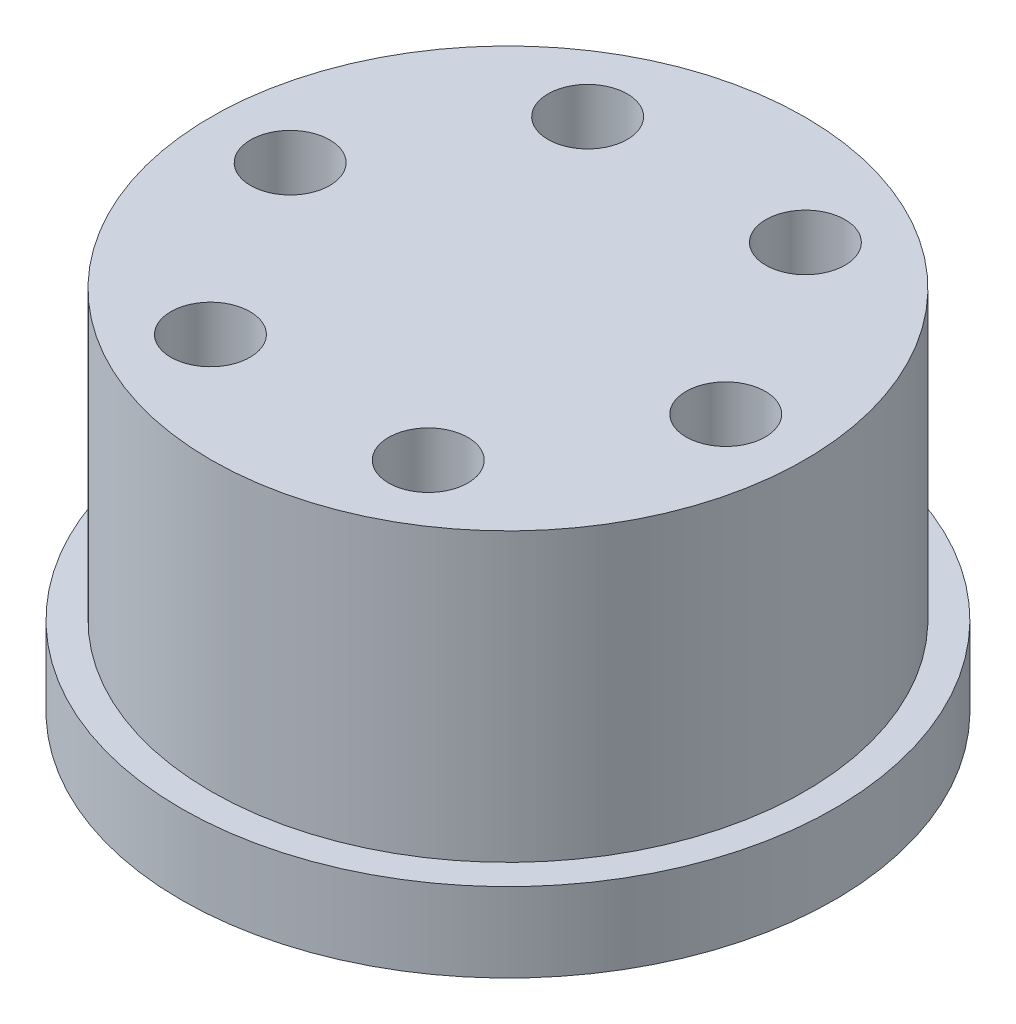
ISO-10303-21;
HEADER;
FILE_DESCRIPTION(('STEP AP214'),'2;1');
FILE_NAME('part.step','',(''),(''),'','','');
FILE_SCHEMA(('AUTOMOTIVE_DESIGN { 1 0 10303 214 1 1 1 1 }'));
ENDSEC;
DATA;
#1=APPLICATION_CONTEXT('core data for automotive mechanical design processes');
#2=APPLICATION_PROTOCOL_DEFINITION('international standard','automotive_design',2000,#1);
#3=PRODUCT_CONTEXT('',#1,'mechanical');
#4=PRODUCT('Part','Part','',(#3));
#5=PRODUCT_RELATED_PRODUCT_CATEGORY('part','',(#4));
#6=PRODUCT_DEFINITION_FORMATION('','',#4);
#7=PRODUCT_DEFINITION_CONTEXT('part definition',#1,'design');
#8=PRODUCT_DEFINITION('design','',#6,#7);
#9=PRODUCT_DEFINITION_SHAPE('','',#8);
#10=(LENGTH_UNIT() NAMED_UNIT(*) SI_UNIT(.MILLI.,.METRE.));
#11=(NAMED_UNIT(*) PLANE_ANGLE_UNIT() SI_UNIT($,.RADIAN.));
#12=(NAMED_UNIT(*) SI_UNIT($,.STERADIAN.) SOLID_ANGLE_UNIT());
#13=UNCERTAINTY_MEASURE_WITH_UNIT(LENGTH_MEASURE(1.E-05),#10,'distance_accuracy_value','');
#14=(GEOMETRIC_REPRESENTATION_CONTEXT(3) GLOBAL_UNCERTAINTY_ASSIGNED_CONTEXT((#13)) GLOBAL_UNIT_ASSIGNED_CONTEXT((#10,
#11,#12)) REPRESENTATION_CONTEXT('',''));
#15=CARTESIAN_POINT('',(0.,0.,0.));
#16=DIRECTION('',(0.,0.,1.));
#17=DIRECTION('',(1.,0.,0.));
#18=AXIS2_PLACEMENT_3D('',#15,#16,#17);
#19=CARTESIAN_POINT('',(0.,4.,0.));
#20=DIRECTION('',(0.,1.,0.));
#21=DIRECTION('',(0.,0.,1.));
#22=AXIS2_PLACEMENT_3D('',#19,#20,#21);
#23=PLANE('',#22);
#24=CARTESIAN_POINT('',(0.,4.,0.));
#25=DIRECTION('',(0.,1.,0.));
#26=DIRECTION('',(0.,0.,1.));
#27=AXIS2_PLACEMENT_3D('',#24,#25,#26);
#28=CIRCLE('',#27,15.);
#29=CARTESIAN_POINT('',(0.,4.,15.));
#30=VERTEX_POINT('',#29);
#31=EDGE_CURVE('E10',#30,#30,#28,.T.);
#32=ORIENTED_EDGE('',*,*,#31,.F.);
#33=EDGE_LOOP('',(#32));
#34=FACE_BOUND('',#33,.T.);
#35=CARTESIAN_POINT('',(0.,4.,0.));
#36=DIRECTION('',(0.,1.,0.));
#37=DIRECTION('',(0.,0.,1.));
#38=AXIS2_PLACEMENT_3D('',#35,#36,#37);
#39=CIRCLE('',#38,16.5);
#40=CARTESIAN_POINT('',(0.,4.,16.5));
#41=VERTEX_POINT('',#40);
#42=EDGE_CURVE('E41',#41,#41,#39,.T.);
#43=ORIENTED_EDGE('',*,*,#42,.T.);
#44=EDGE_LOOP('',(#43));
#45=FACE_BOUND('',#44,.T.);
#46=ADVANCED_FACE('F33',(#34,#45),#23,.T.);
#47=CARTESIAN_POINT('',(0.,0.,0.));
#48=DIRECTION('',(0.,1.,0.));
#49=DIRECTION('',(0.,0.,1.));
#50=AXIS2_PLACEMENT_3D('',#47,#48,#49);
#51=PLANE('',#50);
#52=CARTESIAN_POINT('',(0.,0.,0.));
#53=DIRECTION('',(0.,-1.,0.));
#54=DIRECTION('',(0.,0.,-1.));
#55=AXIS2_PLACEMENT_3D('',#52,#53,#54);
#56=CIRCLE('',#55,7.6);
#57=CARTESIAN_POINT('',(0.,0.,-7.6));
#58=VERTEX_POINT('',#57);
#59=EDGE_CURVE('E179',#58,#58,#56,.T.);
#60=ORIENTED_EDGE('',*,*,#59,.F.);
#61=EDGE_LOOP('',(#60));
#62=FACE_BOUND('',#61,.T.);
#63=CARTESIAN_POINT('',(0.,0.,0.));
#64=DIRECTION('',(0.,1.,0.));
#65=DIRECTION('',(0.,0.,1.));
#66=AXIS2_PLACEMENT_3D('',#63,#64,#65);
#67=CIRCLE('',#66,16.5);
#68=CARTESIAN_POINT('',(0.,0.,16.5));
#69=VERTEX_POINT('',#68);
#70=EDGE_CURVE('E37',#69,#69,#67,.T.);
#71=ORIENTED_EDGE('',*,*,#70,.F.);
#72=EDGE_LOOP('',(#71));
#73=FACE_BOUND('',#72,.T.);
#74=CARTESIAN_POINT('',(0.,0.,-12.5));
#75=DIRECTION('',(0.,1.,0.));
#76=DIRECTION('',(0.,0.,1.));
#77=AXIS2_PLACEMENT_3D('',#74,#75,#76);
#78=CIRCLE('',#77,1.65);
#79=CARTESIAN_POINT('',(0.,0.,-10.85));
#80=VERTEX_POINT('',#79);
#81=EDGE_CURVE('E81',#80,#80,#78,.T.);
#82=ORIENTED_EDGE('',*,*,#81,.T.);
#83=EDGE_LOOP('',(#82));
#84=FACE_BOUND('',#83,.T.);
#85=CARTESIAN_POINT('',(10.8253175473057,0.,-6.25000000000031));
#86=DIRECTION('',(0.,1.,0.));
#87=DIRECTION('',(0.,0.,1.));
#88=AXIS2_PLACEMENT_3D('',#85,#86,#87);
#89=CIRCLE('',#88,1.65);
#90=CARTESIAN_POINT('',(10.8253175473057,0.,-4.60000000000031));
#91=VERTEX_POINT('',#90);
#92=EDGE_CURVE('E76',#91,#91,#89,.T.);
#93=ORIENTED_EDGE('',*,*,#92,.T.);
#94=EDGE_LOOP('',(#93));
#95=FACE_BOUND('',#94,.T.);
#96=CARTESIAN_POINT('',(10.825317547306,0.,6.24999999999969));
#97=DIRECTION('',(0.,1.,0.));
#98=DIRECTION('',(0.,0.,1.));
#99=AXIS2_PLACEMENT_3D('',#96,#97,#98);
#100=CIRCLE('',#99,1.65);
#101=CARTESIAN_POINT('',(10.825317547306,0.,7.89999999999969));
#102=VERTEX_POINT('',#101);
#103=EDGE_CURVE('E70',#102,#102,#100,.T.);
#104=ORIENTED_EDGE('',*,*,#103,.T.);
#105=EDGE_LOOP('',(#104));
#106=FACE_BOUND('',#105,.T.);
#107=CARTESIAN_POINT('',(7.05950310263298E-13,0.,12.5));
#108=DIRECTION('',(0.,1.,0.));
#109=DIRECTION('',(0.,0.,1.));
#110=AXIS2_PLACEMENT_3D('',#107,#108,#109);
#111=CIRCLE('',#110,1.65);
#112=CARTESIAN_POINT('',(7.05950310263298E-13,0.,14.15));
#113=VERTEX_POINT('',#112);
#114=EDGE_CURVE('E64',#113,#113,#111,.T.);
#115=ORIENTED_EDGE('',*,*,#114,.T.);
#116=EDGE_LOOP('',(#115));
#117=FACE_BOUND('',#116,.T.);
#118=CARTESIAN_POINT('',(-10.825317547305,0.,6.25000000000031));
#119=DIRECTION('',(0.,1.,0.));
#120=DIRECTION('',(0.,0.,1.));
#121=AXIS2_PLACEMENT_3D('',#118,#119,#120);
#122=CIRCLE('',#121,1.65);
#123=CARTESIAN_POINT('',(-10.825317547305,0.,7.90000000000031));
#124=VERTEX_POINT('',#123);
#125=EDGE_CURVE('E57',#124,#124,#122,.T.);
#126=ORIENTED_EDGE('',*,*,#125,.T.);
#127=EDGE_LOOP('',(#126));
#128=FACE_BOUND('',#127,.T.);
#129=CARTESIAN_POINT('',(-10.8253175473053,0.,-6.24999999999969));
#130=DIRECTION('',(0.,1.,0.));
#131=DIRECTION('',(0.,0.,1.));
#132=AXIS2_PLACEMENT_3D('',#129,#130,#131);
#133=CIRCLE('',#132,1.65);
#134=CARTESIAN_POINT('',(-10.8253175473053,0.,-4.59999999999969));
#135=VERTEX_POINT('',#134);
#136=EDGE_CURVE('E54',#135,#135,#133,.T.);
#137=ORIENTED_EDGE('',*,*,#136,.T.);
#138=EDGE_LOOP('',(#137));
#139=FACE_BOUND('',#138,.T.);
#140=ADVANCED_FACE('F91',(#62,#73,#84,#95,#106,#117,#128,#139),#51,.F.);
#141=CARTESIAN_POINT('',(0.,4.,0.));
#142=DIRECTION('',(0.,-1.,0.));
#143=DIRECTION('',(0.,0.,-1.));
#144=AXIS2_PLACEMENT_3D('',#141,#142,#143);
#145=CYLINDRICAL_SURFACE('',#144,16.5);
#146=ORIENTED_EDGE('',*,*,#42,.F.);
#147=EDGE_LOOP('',(#146));
#148=FACE_BOUND('',#147,.T.);
#149=ORIENTED_EDGE('',*,*,#70,.T.);
#150=EDGE_LOOP('',(#149));
#151=FACE_BOUND('',#150,.T.);
#152=ADVANCED_FACE('F35',(#148,#151),#145,.T.);
#153=CARTESIAN_POINT('',(0.,4.,-12.5));
#154=DIRECTION('',(0.,-1.,0.));
#155=DIRECTION('',(0.,0.,-1.));
#156=AXIS2_PLACEMENT_3D('',#153,#154,#155);
#157=CYLINDRICAL_SURFACE('',#156,1.65);
#158=CARTESIAN_POINT('',(0.,4.,-12.5));
#159=DIRECTION('',(0.,1.,0.));
#160=DIRECTION('',(0.,0.,1.));
#161=AXIS2_PLACEMENT_3D('',#158,#159,#160);
#162=CIRCLE('',#161,1.65);
#163=CARTESIAN_POINT('',(0.,4.,-10.85));
#164=VERTEX_POINT('',#163);
#165=EDGE_CURVE('E73',#164,#164,#162,.T.);
#166=ORIENTED_EDGE('',*,*,#165,.T.);
#167=EDGE_LOOP('',(#166));
#168=FACE_BOUND('',#167,.T.);
#169=ORIENTED_EDGE('',*,*,#81,.F.);
#170=EDGE_LOOP('',(#169));
#171=FACE_BOUND('',#170,.T.);
#172=ADVANCED_FACE('F129',(#168,#171),#157,.F.);
#173=CARTESIAN_POINT('',(10.8253175473057,4.,-6.25000000000031));
#174=DIRECTION('',(0.,-1.,0.));
#175=DIRECTION('',(0.,0.,-1.));
#176=AXIS2_PLACEMENT_3D('',#173,#174,#175);
#177=CYLINDRICAL_SURFACE('',#176,1.65);
#178=CARTESIAN_POINT('',(10.8253175473057,4.,-6.25000000000031));
#179=DIRECTION('',(0.,1.,0.));
#180=DIRECTION('',(0.,0.,1.));
#181=AXIS2_PLACEMENT_3D('',#178,#179,#180);
#182=CIRCLE('',#181,1.65);
#183=CARTESIAN_POINT('',(10.8253175473057,4.,-4.60000000000031));
#184=VERTEX_POINT('',#183);
#185=EDGE_CURVE('E67',#184,#184,#182,.T.);
#186=ORIENTED_EDGE('',*,*,#185,.T.);
#187=EDGE_LOOP('',(#186));
#188=FACE_BOUND('',#187,.T.);
#189=ORIENTED_EDGE('',*,*,#92,.F.);
#190=EDGE_LOOP('',(#189));
#191=FACE_BOUND('',#190,.T.);
#192=ADVANCED_FACE('F132',(#188,#191),#177,.F.);
#193=CARTESIAN_POINT('',(10.825317547306,4.,6.24999999999969));
#194=DIRECTION('',(0.,-1.,0.));
#195=DIRECTION('',(0.,0.,-1.));
#196=AXIS2_PLACEMENT_3D('',#193,#194,#195);
#197=CYLINDRICAL_SURFACE('',#196,1.65);
#198=CARTESIAN_POINT('',(10.825317547306,4.,6.24999999999969));
#199=DIRECTION('',(0.,1.,0.));
#200=DIRECTION('',(0.,0.,1.));
#201=AXIS2_PLACEMENT_3D('',#198,#199,#200);
#202=CIRCLE('',#201,1.65);
#203=CARTESIAN_POINT('',(10.825317547306,4.,7.89999999999969));
#204=VERTEX_POINT('',#203);
#205=EDGE_CURVE('E61',#204,#204,#202,.T.);
#206=ORIENTED_EDGE('',*,*,#205,.T.);
#207=EDGE_LOOP('',(#206));
#208=FACE_BOUND('',#207,.T.);
#209=ORIENTED_EDGE('',*,*,#103,.F.);
#210=EDGE_LOOP('',(#209));
#211=FACE_BOUND('',#210,.T.);
#212=ADVANCED_FACE('F136',(#208,#211),#197,.F.);
#213=CARTESIAN_POINT('',(7.05950310263298E-13,4.,12.5));
#214=DIRECTION('',(0.,-1.,0.));
#215=DIRECTION('',(0.,0.,-1.));
#216=AXIS2_PLACEMENT_3D('',#213,#214,#215);
#217=CYLINDRICAL_SURFACE('',#216,1.65);
#218=CARTESIAN_POINT('',(7.05950310263298E-13,4.,12.5));
#219=DIRECTION('',(0.,1.,0.));
#220=DIRECTION('',(0.,0.,1.));
#221=AXIS2_PLACEMENT_3D('',#218,#219,#220);
#222=CIRCLE('',#221,1.65);
#223=CARTESIAN_POINT('',(7.05950310263298E-13,4.,14.15));
#224=VERTEX_POINT('',#223);
#225=EDGE_CURVE('E53',#224,#224,#222,.T.);
#226=ORIENTED_EDGE('',*,*,#225,.T.);
#227=EDGE_LOOP('',(#226));
#228=FACE_BOUND('',#227,.T.);
#229=ORIENTED_EDGE('',*,*,#114,.F.);
#230=EDGE_LOOP('',(#229));
#231=FACE_BOUND('',#230,.T.);
#232=ADVANCED_FACE('F118',(#228,#231),#217,.F.);
#233=CARTESIAN_POINT('',(-10.825317547305,4.,6.25000000000031));
#234=DIRECTION('',(0.,-1.,0.));
#235=DIRECTION('',(0.,0.,-1.));
#236=AXIS2_PLACEMENT_3D('',#233,#234,#235);
#237=CYLINDRICAL_SURFACE('',#236,1.65);
#238=CARTESIAN_POINT('',(-10.825317547305,4.,6.25000000000031));
#239=DIRECTION('',(0.,1.,0.));
#240=DIRECTION('',(0.,0.,1.));
#241=AXIS2_PLACEMENT_3D('',#238,#239,#240);
#242=CIRCLE('',#241,1.65);
#243=CARTESIAN_POINT('',(-10.825317547305,4.,7.90000000000031));
#244=VERTEX_POINT('',#243);
#245=EDGE_CURVE('E58',#244,#244,#242,.T.);
#246=ORIENTED_EDGE('',*,*,#245,.T.);
#247=EDGE_LOOP('',(#246));
#248=FACE_BOUND('',#247,.T.);
#249=ORIENTED_EDGE('',*,*,#125,.F.);
#250=EDGE_LOOP('',(#249));
#251=FACE_BOUND('',#250,.T.);
#252=ADVANCED_FACE('F108',(#248,#251),#237,.F.);
#253=CARTESIAN_POINT('',(-10.8253175473053,4.,-6.24999999999969));
#254=DIRECTION('',(0.,-1.,0.));
#255=DIRECTION('',(0.,0.,-1.));
#256=AXIS2_PLACEMENT_3D('',#253,#254,#255);
#257=CYLINDRICAL_SURFACE('',#256,1.65);
#258=CARTESIAN_POINT('',(-10.8253175473053,4.,-6.24999999999969));
#259=DIRECTION('',(0.,1.,0.));
#260=DIRECTION('',(0.,0.,1.));
#261=AXIS2_PLACEMENT_3D('',#258,#259,#260);
#262=CIRCLE('',#261,1.65);
#263=CARTESIAN_POINT('',(-10.8253175473053,4.,-4.59999999999969));
#264=VERTEX_POINT('',#263);
#265=EDGE_CURVE('E50',#264,#264,#262,.T.);
#266=ORIENTED_EDGE('',*,*,#265,.T.);
#267=EDGE_LOOP('',(#266));
#268=FACE_BOUND('',#267,.T.);
#269=ORIENTED_EDGE('',*,*,#136,.F.);
#270=EDGE_LOOP('',(#269));
#271=FACE_BOUND('',#270,.T.);
#272=ADVANCED_FACE('F105',(#268,#271),#257,.F.);
#273=CARTESIAN_POINT('',(0.,18.5,0.));
#274=DIRECTION('',(0.,1.,0.));
#275=DIRECTION('',(0.,0.,1.));
#276=AXIS2_PLACEMENT_3D('',#273,#274,#275);
#277=PLANE('',#276);
#278=CARTESIAN_POINT('',(-11.,18.5,0.));
#279=DIRECTION('',(0.,1.,0.));
#280=DIRECTION('',(0.,0.,1.));
#281=AXIS2_PLACEMENT_3D('',#278,#279,#280);
#282=CIRCLE('',#281,2.);
#283=CARTESIAN_POINT('',(-11.,18.5,2.));
#284=VERTEX_POINT('',#283);
#285=EDGE_CURVE('E171',#284,#284,#282,.T.);
#286=ORIENTED_EDGE('',*,*,#285,.F.);
#287=EDGE_LOOP('',(#286));
#288=FACE_BOUND('',#287,.T.);
#289=CARTESIAN_POINT('',(-5.49999999999999,18.5,9.52627944162883));
#290=DIRECTION('',(0.,1.,0.));
#291=DIRECTION('',(0.,0.,1.));
#292=AXIS2_PLACEMENT_3D('',#289,#290,#291);
#293=CIRCLE('',#292,2.);
#294=CARTESIAN_POINT('',(-5.49999999999999,18.5,11.5262794416288));
#295=VERTEX_POINT('',#294);
#296=EDGE_CURVE('E186',#295,#295,#293,.T.);
#297=ORIENTED_EDGE('',*,*,#296,.F.);
#298=EDGE_LOOP('',(#297));
#299=FACE_BOUND('',#298,.T.);
#300=CARTESIAN_POINT('',(5.5,18.5,9.52627944162882));
#301=DIRECTION('',(0.,1.,0.));
#302=DIRECTION('',(0.,0.,1.));
#303=AXIS2_PLACEMENT_3D('',#300,#301,#302);
#304=CIRCLE('',#303,2.);
#305=CARTESIAN_POINT('',(5.5,18.5,11.5262794416288));
#306=VERTEX_POINT('',#305);
#307=EDGE_CURVE('E185',#306,#306,#304,.T.);
#308=ORIENTED_EDGE('',*,*,#307,.F.);
#309=EDGE_LOOP('',(#308));
#310=FACE_BOUND('',#309,.T.);
#311=CARTESIAN_POINT('',(11.,18.5,0.));
#312=DIRECTION('',(0.,1.,0.));
#313=DIRECTION('',(0.,0.,1.));
#314=AXIS2_PLACEMENT_3D('',#311,#312,#313);
#315=CIRCLE('',#314,2.);
#316=CARTESIAN_POINT('',(11.,18.5,2.));
#317=VERTEX_POINT('',#316);
#318=EDGE_CURVE('E204',#317,#317,#315,.T.);
#319=ORIENTED_EDGE('',*,*,#318,.F.);
#320=EDGE_LOOP('',(#319));
#321=FACE_BOUND('',#320,.T.);
#322=CARTESIAN_POINT('',(5.5,18.5,-9.52627944162883));
#323=DIRECTION('',(0.,1.,0.));
#324=DIRECTION('',(0.,0.,1.));
#325=AXIS2_PLACEMENT_3D('',#322,#323,#324);
#326=CIRCLE('',#325,2.);
#327=CARTESIAN_POINT('',(5.5,18.5,-7.52627944162883));
#328=VERTEX_POINT('',#327);
#329=EDGE_CURVE('E198',#328,#328,#326,.T.);
#330=ORIENTED_EDGE('',*,*,#329,.F.);
#331=EDGE_LOOP('',(#330));
#332=FACE_BOUND('',#331,.T.);
#333=CARTESIAN_POINT('',(-5.5,18.5,-9.52627944162882));
#334=DIRECTION('',(0.,1.,0.));
#335=DIRECTION('',(0.,0.,1.));
#336=AXIS2_PLACEMENT_3D('',#333,#334,#335);
#337=CIRCLE('',#336,2.);
#338=CARTESIAN_POINT('',(-5.5,18.5,-7.52627944162882));
#339=VERTEX_POINT('',#338);
#340=EDGE_CURVE('E192',#339,#339,#337,.T.);
#341=ORIENTED_EDGE('',*,*,#340,.F.);
#342=EDGE_LOOP('',(#341));
#343=FACE_BOUND('',#342,.T.);
#344=CARTESIAN_POINT('',(0.,18.5,0.));
#345=DIRECTION('',(0.,1.,0.));
#346=DIRECTION('',(0.,0.,1.));
#347=AXIS2_PLACEMENT_3D('',#344,#345,#346);
#348=CIRCLE('',#347,15.);
#349=CARTESIAN_POINT('',(0.,18.5,15.));
#350=VERTEX_POINT('',#349);
#351=EDGE_CURVE('E48',#350,#350,#348,.T.);
#352=ORIENTED_EDGE('',*,*,#351,.T.);
#353=EDGE_LOOP('',(#352));
#354=FACE_BOUND('',#353,.T.);
#355=ADVANCED_FACE('F107',(#288,#299,#310,#321,#332,#343,#354),#277,.T.);
#356=CARTESIAN_POINT('',(0.,18.5,0.));
#357=DIRECTION('',(0.,-1.,0.));
#358=DIRECTION('',(0.,0.,-1.));
#359=AXIS2_PLACEMENT_3D('',#356,#357,#358);
#360=CYLINDRICAL_SURFACE('',#359,15.);
#361=ORIENTED_EDGE('',*,*,#351,.F.);
#362=EDGE_LOOP('',(#361));
#363=FACE_BOUND('',#362,.T.);
#364=ORIENTED_EDGE('',*,*,#31,.T.);
#365=EDGE_LOOP('',(#364));
#366=FACE_BOUND('',#365,.T.);
#367=ADVANCED_FACE('F115',(#363,#366),#360,.T.);
#368=CARTESIAN_POINT('',(0.,4.,0.));
#369=DIRECTION('',(0.,1.,0.));
#370=DIRECTION('',(0.,0.,1.));
#371=AXIS2_PLACEMENT_3D('',#368,#369,#370);
#372=PLANE('',#371);
#373=ORIENTED_EDGE('',*,*,#265,.F.);
#374=EDGE_LOOP('',(#373));
#375=FACE_BOUND('',#374,.T.);
#376=ADVANCED_FACE('F151',(#375),#372,.F.);
#377=ORIENTED_EDGE('',*,*,#225,.F.);
#378=EDGE_LOOP('',(#377));
#379=FACE_BOUND('',#378,.T.);
#380=ADVANCED_FACE('F148',(#379),#372,.F.);
#381=ORIENTED_EDGE('',*,*,#185,.F.);
#382=EDGE_LOOP('',(#381));
#383=FACE_BOUND('',#382,.T.);
#384=ADVANCED_FACE('F150',(#383),#372,.F.);
#385=ORIENTED_EDGE('',*,*,#165,.F.);
#386=EDGE_LOOP('',(#385));
#387=FACE_BOUND('',#386,.T.);
#388=ADVANCED_FACE('F157',(#387),#372,.F.);
#389=ORIENTED_EDGE('',*,*,#205,.F.);
#390=EDGE_LOOP('',(#389));
#391=FACE_BOUND('',#390,.T.);
#392=ADVANCED_FACE('F233',(#391),#372,.F.);
#393=ORIENTED_EDGE('',*,*,#245,.F.);
#394=EDGE_LOOP('',(#393));
#395=FACE_BOUND('',#394,.T.);
#396=ADVANCED_FACE('F160',(#395),#372,.F.);
#397=CARTESIAN_POINT('',(-5.5,12.,-9.52627944162882));
#398=DIRECTION('',(0.,1.,0.));
#399=DIRECTION('',(0.,0.,1.));
#400=AXIS2_PLACEMENT_3D('',#397,#398,#399);
#401=CYLINDRICAL_SURFACE('',#400,2.);
#402=CARTESIAN_POINT('',(-5.5,12.,-9.52627944162882));
#403=DIRECTION('',(0.,1.,0.));
#404=DIRECTION('',(0.,0.,1.));
#405=AXIS2_PLACEMENT_3D('',#402,#403,#404);
#406=CIRCLE('',#405,2.);
#407=CARTESIAN_POINT('',(-5.5,12.,-7.52627944162882));
#408=VERTEX_POINT('',#407);
#409=EDGE_CURVE('E176',#408,#408,#406,.T.);
#410=ORIENTED_EDGE('',*,*,#409,.F.);
#411=EDGE_LOOP('',(#410));
#412=FACE_BOUND('',#411,.T.);
#413=ORIENTED_EDGE('',*,*,#340,.T.);
#414=EDGE_LOOP('',(#413));
#415=FACE_BOUND('',#414,.T.);
#416=ADVANCED_FACE('F221',(#412,#415),#401,.F.);
#417=CARTESIAN_POINT('',(-5.5,12.,-9.52627944162882));
#418=DIRECTION('',(0.,1.,0.));
#419=DIRECTION('',(0.,0.,1.));
#420=AXIS2_PLACEMENT_3D('',#417,#418,#419);
#421=PLANE('',#420);
#422=ORIENTED_EDGE('',*,*,#409,.T.);
#423=EDGE_LOOP('',(#422));
#424=FACE_BOUND('',#423,.T.);
#425=ADVANCED_FACE('F223',(#424),#421,.T.);
#426=CARTESIAN_POINT('',(5.5,12.,-9.52627944162883));
#427=DIRECTION('',(0.,1.,0.));
#428=DIRECTION('',(0.,0.,1.));
#429=AXIS2_PLACEMENT_3D('',#426,#427,#428);
#430=CYLINDRICAL_SURFACE('',#429,2.);
#431=CARTESIAN_POINT('',(5.5,12.,-9.52627944162883));
#432=DIRECTION('',(0.,1.,0.));
#433=DIRECTION('',(0.,0.,1.));
#434=AXIS2_PLACEMENT_3D('',#431,#432,#433);
#435=CIRCLE('',#434,2.);
#436=CARTESIAN_POINT('',(5.5,12.,-7.52627944162883));
#437=VERTEX_POINT('',#436);
#438=EDGE_CURVE('E195',#437,#437,#435,.T.);
#439=ORIENTED_EDGE('',*,*,#438,.F.);
#440=EDGE_LOOP('',(#439));
#441=FACE_BOUND('',#440,.T.);
#442=ORIENTED_EDGE('',*,*,#329,.T.);
#443=EDGE_LOOP('',(#442));
#444=FACE_BOUND('',#443,.T.);
#445=ADVANCED_FACE('F230',(#441,#444),#430,.F.);
#446=CARTESIAN_POINT('',(5.5,12.,-9.52627944162883));
#447=DIRECTION('',(0.,1.,0.));
#448=DIRECTION('',(0.,0.,1.));
#449=AXIS2_PLACEMENT_3D('',#446,#447,#448);
#450=PLANE('',#449);
#451=ORIENTED_EDGE('',*,*,#438,.T.);
#452=EDGE_LOOP('',(#451));
#453=FACE_BOUND('',#452,.T.);
#454=ADVANCED_FACE('F238',(#453),#450,.T.);
#455=CARTESIAN_POINT('',(11.,12.,0.));
#456=DIRECTION('',(0.,1.,0.));
#457=DIRECTION('',(0.,0.,1.));
#458=AXIS2_PLACEMENT_3D('',#455,#456,#457);
#459=CYLINDRICAL_SURFACE('',#458,2.);
#460=CARTESIAN_POINT('',(11.,12.,0.));
#461=DIRECTION('',(0.,1.,0.));
#462=DIRECTION('',(0.,0.,1.));
#463=AXIS2_PLACEMENT_3D('',#460,#461,#462);
#464=CIRCLE('',#463,2.);
#465=CARTESIAN_POINT('',(11.,12.,2.));
#466=VERTEX_POINT('',#465);
#467=EDGE_CURVE('E201',#466,#466,#464,.T.);
#468=ORIENTED_EDGE('',*,*,#467,.F.);
#469=EDGE_LOOP('',(#468));
#470=FACE_BOUND('',#469,.T.);
#471=ORIENTED_EDGE('',*,*,#318,.T.);
#472=EDGE_LOOP('',(#471));
#473=FACE_BOUND('',#472,.T.);
#474=ADVANCED_FACE('F241',(#470,#473),#459,.F.);
#475=CARTESIAN_POINT('',(11.,12.,0.));
#476=DIRECTION('',(0.,1.,0.));
#477=DIRECTION('',(0.,0.,1.));
#478=AXIS2_PLACEMENT_3D('',#475,#476,#477);
#479=PLANE('',#478);
#480=ORIENTED_EDGE('',*,*,#467,.T.);
#481=EDGE_LOOP('',(#480));
#482=FACE_BOUND('',#481,.T.);
#483=ADVANCED_FACE('F246',(#482),#479,.T.);
#484=CARTESIAN_POINT('',(5.5,12.,9.52627944162882));
#485=DIRECTION('',(0.,1.,0.));
#486=DIRECTION('',(0.,0.,1.));
#487=AXIS2_PLACEMENT_3D('',#484,#485,#486);
#488=CYLINDRICAL_SURFACE('',#487,2.);
#489=CARTESIAN_POINT('',(5.5,12.,9.52627944162882));
#490=DIRECTION('',(0.,1.,0.));
#491=DIRECTION('',(0.,0.,1.));
#492=AXIS2_PLACEMENT_3D('',#489,#490,#491);
#493=CIRCLE('',#492,2.);
#494=CARTESIAN_POINT('',(5.5,12.,11.5262794416288));
#495=VERTEX_POINT('',#494);
#496=EDGE_CURVE('E207',#495,#495,#493,.T.);
#497=ORIENTED_EDGE('',*,*,#496,.F.);
#498=EDGE_LOOP('',(#497));
#499=FACE_BOUND('',#498,.T.);
#500=ORIENTED_EDGE('',*,*,#307,.T.);
#501=EDGE_LOOP('',(#500));
#502=FACE_BOUND('',#501,.T.);
#503=ADVANCED_FACE('F212',(#499,#502),#488,.F.);
#504=CARTESIAN_POINT('',(5.5,12.,9.52627944162882));
#505=DIRECTION('',(0.,1.,0.));
#506=DIRECTION('',(0.,0.,1.));
#507=AXIS2_PLACEMENT_3D('',#504,#505,#506);
#508=PLANE('',#507);
#509=ORIENTED_EDGE('',*,*,#496,.T.);
#510=EDGE_LOOP('',(#509));
#511=FACE_BOUND('',#510,.T.);
#512=ADVANCED_FACE('F253',(#511),#508,.T.);
#513=CARTESIAN_POINT('',(-5.49999999999999,12.,9.52627944162883));
#514=DIRECTION('',(0.,1.,0.));
#515=DIRECTION('',(0.,0.,1.));
#516=AXIS2_PLACEMENT_3D('',#513,#514,#515);
#517=CYLINDRICAL_SURFACE('',#516,2.);
#518=CARTESIAN_POINT('',(-5.49999999999999,12.,9.52627944162883));
#519=DIRECTION('',(0.,1.,0.));
#520=DIRECTION('',(0.,0.,1.));
#521=AXIS2_PLACEMENT_3D('',#518,#519,#520);
#522=CIRCLE('',#521,2.);
#523=CARTESIAN_POINT('',(-5.49999999999999,12.,11.5262794416288));
#524=VERTEX_POINT('',#523);
#525=EDGE_CURVE('E182',#524,#524,#522,.T.);
#526=ORIENTED_EDGE('',*,*,#525,.F.);
#527=EDGE_LOOP('',(#526));
#528=FACE_BOUND('',#527,.T.);
#529=ORIENTED_EDGE('',*,*,#296,.T.);
#530=EDGE_LOOP('',(#529));
#531=FACE_BOUND('',#530,.T.);
#532=ADVANCED_FACE('F255',(#528,#531),#517,.F.);
#533=CARTESIAN_POINT('',(-5.49999999999999,12.,9.52627944162883));
#534=DIRECTION('',(0.,1.,0.));
#535=DIRECTION('',(0.,0.,1.));
#536=AXIS2_PLACEMENT_3D('',#533,#534,#535);
#537=PLANE('',#536);
#538=ORIENTED_EDGE('',*,*,#525,.T.);
#539=EDGE_LOOP('',(#538));
#540=FACE_BOUND('',#539,.T.);
#541=ADVANCED_FACE('F274',(#540),#537,.T.);
#542=CARTESIAN_POINT('',(-11.,12.,0.));
#543=DIRECTION('',(0.,1.,0.));
#544=DIRECTION('',(0.,0.,1.));
#545=AXIS2_PLACEMENT_3D('',#542,#543,#544);
#546=CYLINDRICAL_SURFACE('',#545,2.);
#547=CARTESIAN_POINT('',(-11.,12.,0.));
#548=DIRECTION('',(0.,1.,0.));
#549=DIRECTION('',(0.,0.,1.));
#550=AXIS2_PLACEMENT_3D('',#547,#548,#549);
#551=CIRCLE('',#550,2.);
#552=CARTESIAN_POINT('',(-11.,12.,2.));
#553=VERTEX_POINT('',#552);
#554=EDGE_CURVE('E169',#553,#553,#551,.T.);
#555=ORIENTED_EDGE('',*,*,#554,.F.);
#556=EDGE_LOOP('',(#555));
#557=FACE_BOUND('',#556,.T.);
#558=ORIENTED_EDGE('',*,*,#285,.T.);
#559=EDGE_LOOP('',(#558));
#560=FACE_BOUND('',#559,.T.);
#561=ADVANCED_FACE('F281',(#557,#560),#546,.F.);
#562=CARTESIAN_POINT('',(-11.,12.,0.));
#563=DIRECTION('',(0.,1.,0.));
#564=DIRECTION('',(0.,0.,1.));
#565=AXIS2_PLACEMENT_3D('',#562,#563,#564);
#566=PLANE('',#565);
#567=ORIENTED_EDGE('',*,*,#554,.T.);
#568=EDGE_LOOP('',(#567));
#569=FACE_BOUND('',#568,.T.);
#570=ADVANCED_FACE('F289',(#569),#566,.T.);
#571=CARTESIAN_POINT('',(0.,5.,0.));
#572=DIRECTION('',(0.,-1.,0.));
#573=DIRECTION('',(0.,0.,-1.));
#574=AXIS2_PLACEMENT_3D('',#571,#572,#573);
#575=CYLINDRICAL_SURFACE('',#574,7.6);
#576=CARTESIAN_POINT('',(0.,5.,0.));
#577=DIRECTION('',(0.,-1.,0.));
#578=DIRECTION('',(0.,0.,-1.));
#579=AXIS2_PLACEMENT_3D('',#576,#577,#578);
#580=CIRCLE('',#579,7.6);
#581=CARTESIAN_POINT('',(0.,5.,-7.6));
#582=VERTEX_POINT('',#581);
#583=EDGE_CURVE('E189',#582,#582,#580,.T.);
#584=ORIENTED_EDGE('',*,*,#583,.F.);
#585=EDGE_LOOP('',(#584));
#586=FACE_BOUND('',#585,.T.);
#587=ORIENTED_EDGE('',*,*,#59,.T.);
#588=EDGE_LOOP('',(#587));
#589=FACE_BOUND('',#588,.T.);
#590=ADVANCED_FACE('F297',(#586,#589),#575,.F.);
#591=CARTESIAN_POINT('',(0.,5.,0.));
#592=DIRECTION('',(0.,-1.,0.));
#593=DIRECTION('',(0.,0.,-1.));
#594=AXIS2_PLACEMENT_3D('',#591,#592,#593);
#595=PLANE('',#594);
#596=ORIENTED_EDGE('',*,*,#583,.T.);
#597=EDGE_LOOP('',(#596));
#598=FACE_BOUND('',#597,.T.);
#599=ADVANCED_FACE('F305',(#598),#595,.T.);
#600=CLOSED_SHELL('',(#46,#140,#152,#172,#192,#212,#232,#252,#272,#355,#367,#376,#380,#384,#388,
#392,#396,#416,#425,#445,#454,#474,#483,#503,#512,#532,#541,#561,#570,#590,#599));
#601=MANIFOLD_SOLID_BREP('B2',#600);
#602=ADVANCED_BREP_SHAPE_REPRESENTATION('',(#18,#601),#14);
#603=SHAPE_DEFINITION_REPRESENTATION(#9,#602);
ENDSEC;
END-ISO-10303-21;
